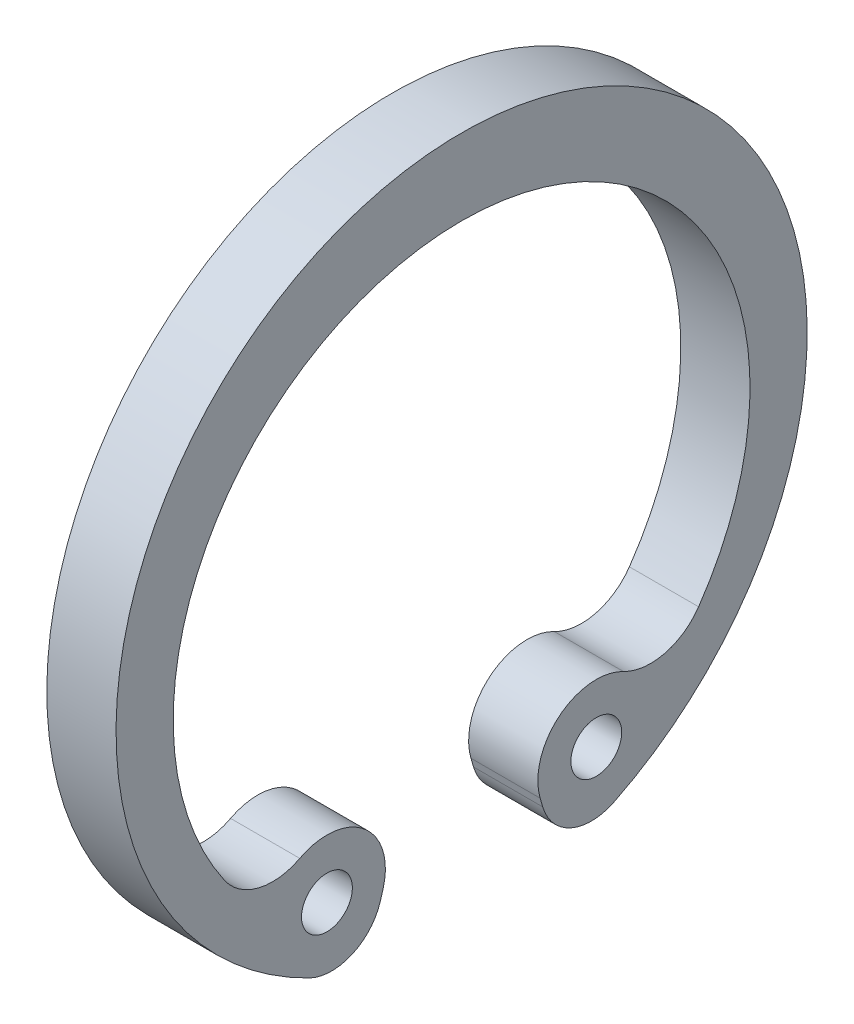
ISO-10303-21;
HEADER;
FILE_DESCRIPTION(('STEP AP214'),'2;1');
FILE_NAME('part.step','',(''),(''),'','','');
FILE_SCHEMA(('AUTOMOTIVE_DESIGN { 1 0 10303 214 1 1 1 1 }'));
ENDSEC;
DATA;
#1=APPLICATION_CONTEXT('core data for automotive mechanical design processes');
#2=APPLICATION_PROTOCOL_DEFINITION('international standard','automotive_design',2000,#1);
#3=PRODUCT_CONTEXT('',#1,'mechanical');
#4=PRODUCT('Part','Part','',(#3));
#5=PRODUCT_RELATED_PRODUCT_CATEGORY('part','',(#4));
#6=PRODUCT_DEFINITION_FORMATION('','',#4);
#7=PRODUCT_DEFINITION_CONTEXT('part definition',#1,'design');
#8=PRODUCT_DEFINITION('design','',#6,#7);
#9=PRODUCT_DEFINITION_SHAPE('','',#8);
#10=(LENGTH_UNIT() NAMED_UNIT(*) SI_UNIT(.MILLI.,.METRE.));
#11=(NAMED_UNIT(*) PLANE_ANGLE_UNIT() SI_UNIT($,.RADIAN.));
#12=(NAMED_UNIT(*) SI_UNIT($,.STERADIAN.) SOLID_ANGLE_UNIT());
#13=UNCERTAINTY_MEASURE_WITH_UNIT(LENGTH_MEASURE(1.E-05),#10,'distance_accuracy_value','');
#14=(GEOMETRIC_REPRESENTATION_CONTEXT(3) GLOBAL_UNCERTAINTY_ASSIGNED_CONTEXT((#13)) GLOBAL_UNIT_ASSIGNED_CONTEXT((#10,
#11,#12)) REPRESENTATION_CONTEXT('',''));
#15=CARTESIAN_POINT('',(0.,0.,0.));
#16=DIRECTION('',(0.,0.,1.));
#17=DIRECTION('',(1.,0.,0.));
#18=AXIS2_PLACEMENT_3D('',#15,#16,#17);
#19=CARTESIAN_POINT('',(-0.6,-4.58686828511237,-2.25257408608243));
#20=DIRECTION('',(1.,0.,0.));
#21=DIRECTION('',(0.,0.,-1.));
#22=AXIS2_PLACEMENT_3D('',#19,#20,#21);
#23=CYLINDRICAL_SURFACE('',#22,0.881057268722478);
#24=CARTESIAN_POINT('',(0.6,-4.58686828511237,-2.25257408608243));
#25=DIRECTION('',(1.,0.,0.));
#26=DIRECTION('',(0.,0.,-1.));
#27=AXIS2_PLACEMENT_3D('',#24,#25,#26);
#28=CIRCLE('',#27,0.881057268722478);
#29=CARTESIAN_POINT('',(0.6,-4.83307544942581,-1.40661667402822));
#30=VERTEX_POINT('',#29);
#31=CARTESIAN_POINT('',(0.6,-5.37770764461454,-2.64094892851035));
#32=VERTEX_POINT('',#31);
#33=EDGE_CURVE('E142',#30,#32,#28,.T.);
#34=ORIENTED_EDGE('',*,*,#33,.F.);
#35=DIRECTION('',(1.,0.,0.));
#36=VECTOR('',#35,1.);
#37=CARTESIAN_POINT('',(-0.6,-4.83307544942581,-1.40661667402822));
#38=LINE('',#37,#36);
#39=CARTESIAN_POINT('',(-0.6,-4.83307544942581,-1.40661667402822));
#40=VERTEX_POINT('',#39);
#41=EDGE_CURVE('E11',#40,#30,#38,.T.);
#42=ORIENTED_EDGE('',*,*,#41,.F.);
#43=CARTESIAN_POINT('',(-0.6,-4.58686828511237,-2.25257408608243));
#44=DIRECTION('',(1.,0.,0.));
#45=DIRECTION('',(0.,0.,-1.));
#46=AXIS2_PLACEMENT_3D('',#43,#44,#45);
#47=CIRCLE('',#46,0.881057268722478);
#48=CARTESIAN_POINT('',(-0.6,-5.37770764461454,-2.64094892851035));
#49=VERTEX_POINT('',#48);
#50=EDGE_CURVE('E169',#40,#49,#47,.T.);
#51=ORIENTED_EDGE('',*,*,#50,.T.);
#52=DIRECTION('',(1.,0.,0.));
#53=VECTOR('',#52,1.);
#54=CARTESIAN_POINT('',(-0.6,-5.37770764461454,-2.64094892851035));
#55=LINE('',#54,#53);
#56=EDGE_CURVE('E36',#49,#32,#55,.T.);
#57=ORIENTED_EDGE('',*,*,#56,.T.);
#58=EDGE_LOOP('',(#34,#42,#51,#57));
#59=FACE_BOUND('',#58,.T.);
#60=ADVANCED_FACE('F33',(#59),#23,.T.);
#61=CARTESIAN_POINT('',(-0.6,-4.67960518164758,-1.36195073825215));
#62=DIRECTION('',(0.,-0.279445131495752,0.96016166268151));
#63=DIRECTION('',(0.,-0.96016166268151,-0.279445131495752));
#64=AXIS2_PLACEMENT_3D('',#61,#62,#63);
#65=PLANE('',#64);
#66=DIRECTION('',(0.,-0.96016166268151,-0.279445131495752));
#67=VECTOR('',#66,1.);
#68=CARTESIAN_POINT('',(0.6,-4.67960518164758,-1.36195073825215));
#69=LINE('',#68,#67);
#70=CARTESIAN_POINT('',(0.6,-4.67960518164758,-1.36195073825215));
#71=VERTEX_POINT('',#70);
#72=EDGE_CURVE('E167',#71,#30,#69,.T.);
#73=ORIENTED_EDGE('',*,*,#72,.F.);
#74=DIRECTION('',(1.,0.,0.));
#75=VECTOR('',#74,1.);
#76=CARTESIAN_POINT('',(-0.6,-4.67960518164758,-1.36195073825215));
#77=LINE('',#76,#75);
#78=CARTESIAN_POINT('',(-0.6,-4.67960518164758,-1.36195073825215));
#79=VERTEX_POINT('',#78);
#80=EDGE_CURVE('E42',#79,#71,#77,.T.);
#81=ORIENTED_EDGE('',*,*,#80,.F.);
#82=DIRECTION('',(0.,-0.96016166268151,-0.279445131495752));
#83=VECTOR('',#82,1.);
#84=CARTESIAN_POINT('',(-0.6,-4.67960518164758,-1.36195073825215));
#85=LINE('',#84,#83);
#86=EDGE_CURVE('E132',#79,#40,#85,.T.);
#87=ORIENTED_EDGE('',*,*,#86,.T.);
#88=ORIENTED_EDGE('',*,*,#41,.T.);
#89=EDGE_LOOP('',(#73,#81,#87,#88));
#90=FACE_BOUND('',#89,.T.);
#91=ADVANCED_FACE('F185',(#90),#65,.T.);
#92=CARTESIAN_POINT('',(-0.6,-4.39646694268709,-2.33480176211454));
#93=DIRECTION('',(1.,0.,0.));
#94=DIRECTION('',(0.,0.,-1.));
#95=AXIS2_PLACEMENT_3D('',#92,#93,#94);
#96=CYLINDRICAL_SURFACE('',#95,1.01321585903087);
#97=CARTESIAN_POINT('',(0.6,-4.39646694268709,-2.33480176211454));
#98=DIRECTION('',(1.,0.,0.));
#99=DIRECTION('',(0.,0.,-1.));
#100=AXIS2_PLACEMENT_3D('',#97,#98,#99);
#101=CIRCLE('',#100,1.01321585903087);
#102=CARTESIAN_POINT('',(0.6,-3.49924782725715,-2.80555035308298));
#103=VERTEX_POINT('',#102);
#104=EDGE_CURVE('E119',#103,#71,#101,.T.);
#105=ORIENTED_EDGE('',*,*,#104,.F.);
#106=DIRECTION('',(1.,0.,0.));
#107=VECTOR('',#106,1.);
#108=CARTESIAN_POINT('',(-0.6,-3.49924782725715,-2.80555035308298));
#109=LINE('',#108,#107);
#110=CARTESIAN_POINT('',(-0.6,-3.49924782725715,-2.80555035308298));
#111=VERTEX_POINT('',#110);
#112=EDGE_CURVE('E114',#111,#103,#109,.T.);
#113=ORIENTED_EDGE('',*,*,#112,.F.);
#114=CARTESIAN_POINT('',(-0.6,-4.39646694268709,-2.33480176211454));
#115=DIRECTION('',(1.,0.,0.));
#116=DIRECTION('',(0.,0.,-1.));
#117=AXIS2_PLACEMENT_3D('',#114,#115,#116);
#118=CIRCLE('',#117,1.01321585903087);
#119=EDGE_CURVE('E117',#111,#79,#118,.T.);
#120=ORIENTED_EDGE('',*,*,#119,.T.);
#121=ORIENTED_EDGE('',*,*,#80,.T.);
#122=EDGE_LOOP('',(#105,#113,#120,#121));
#123=FACE_BOUND('',#122,.T.);
#124=ADVANCED_FACE('F116',(#123),#96,.T.);
#125=CARTESIAN_POINT('',(-0.6,-2.6020287118272,-3.27629894405145));
#126=DIRECTION('',(1.,0.,0.));
#127=DIRECTION('',(0.,0.,-1.));
#128=AXIS2_PLACEMENT_3D('',#125,#126,#127);
#129=CYLINDRICAL_SURFACE('',#128,1.01321585903093);
#130=CARTESIAN_POINT('',(0.6,-2.6020287118272,-3.27629894405145));
#131=DIRECTION('',(-1.,0.,0.));
#132=DIRECTION('',(0.,0.,1.));
#133=AXIS2_PLACEMENT_3D('',#130,#131,#132);
#134=CIRCLE('',#133,1.01321585903093);
#135=CARTESIAN_POINT('',(0.6,-3.17934961159855,-4.10894950441815));
#136=VERTEX_POINT('',#135);
#137=EDGE_CURVE('E164',#136,#103,#134,.T.);
#138=ORIENTED_EDGE('',*,*,#137,.F.);
#139=DIRECTION('',(1.,0.,0.));
#140=VECTOR('',#139,1.);
#141=CARTESIAN_POINT('',(-0.6,-3.17934961159855,-4.10894950441815));
#142=LINE('',#141,#140);
#143=CARTESIAN_POINT('',(-0.6,-3.17934961159855,-4.10894950441815));
#144=VERTEX_POINT('',#143);
#145=EDGE_CURVE('E124',#144,#136,#142,.T.);
#146=ORIENTED_EDGE('',*,*,#145,.F.);
#147=CARTESIAN_POINT('',(-0.6,-2.6020287118272,-3.27629894405145));
#148=DIRECTION('',(-1.,0.,0.));
#149=DIRECTION('',(0.,0.,1.));
#150=AXIS2_PLACEMENT_3D('',#147,#148,#149);
#151=CIRCLE('',#150,1.01321585903093);
#152=EDGE_CURVE('E130',#144,#111,#151,.T.);
#153=ORIENTED_EDGE('',*,*,#152,.T.);
#154=ORIENTED_EDGE('',*,*,#112,.T.);
#155=EDGE_LOOP('',(#138,#146,#153,#154));
#156=FACE_BOUND('',#155,.T.);
#157=ADVANCED_FACE('F134',(#156),#129,.F.);
#158=CARTESIAN_POINT('',(-0.6,-0.330396475770925,0.));
#159=DIRECTION('',(1.,0.,0.));
#160=DIRECTION('',(0.,0.,-1.));
#161=AXIS2_PLACEMENT_3D('',#158,#159,#160);
#162=CYLINDRICAL_SURFACE('',#161,5.);
#163=CARTESIAN_POINT('',(0.6,-0.330396475770925,0.));
#164=DIRECTION('',(-1.,0.,0.));
#165=DIRECTION('',(0.,0.,1.));
#166=AXIS2_PLACEMENT_3D('',#163,#164,#165);
#167=CIRCLE('',#166,5.);
#168=CARTESIAN_POINT('',(0.6,-3.17934961159847,4.10894950441815));
#169=VERTEX_POINT('',#168);
#170=EDGE_CURVE('E161',#169,#136,#167,.T.);
#171=ORIENTED_EDGE('',*,*,#170,.F.);
#172=DIRECTION('',(1.,0.,0.));
#173=VECTOR('',#172,1.);
#174=CARTESIAN_POINT('',(-0.6,-3.17934961159847,4.10894950441815));
#175=LINE('',#174,#173);
#176=CARTESIAN_POINT('',(-0.6,-3.17934961159847,4.10894950441815));
#177=VERTEX_POINT('',#176);
#178=EDGE_CURVE('E173',#177,#169,#175,.T.);
#179=ORIENTED_EDGE('',*,*,#178,.F.);
#180=CARTESIAN_POINT('',(-0.6,-0.330396475770925,0.));
#181=DIRECTION('',(-1.,0.,0.));
#182=DIRECTION('',(0.,0.,1.));
#183=AXIS2_PLACEMENT_3D('',#180,#181,#182);
#184=CIRCLE('',#183,5.);
#185=EDGE_CURVE('E135',#177,#144,#184,.T.);
#186=ORIENTED_EDGE('',*,*,#185,.T.);
#187=ORIENTED_EDGE('',*,*,#145,.T.);
#188=EDGE_LOOP('',(#171,#179,#186,#187));
#189=FACE_BOUND('',#188,.T.);
#190=ADVANCED_FACE('F198',(#189),#162,.F.);
#191=CARTESIAN_POINT('',(-0.6,-2.60202871182723,3.27629894405141));
#192=DIRECTION('',(1.,0.,0.));
#193=DIRECTION('',(0.,0.,-1.));
#194=AXIS2_PLACEMENT_3D('',#191,#192,#193);
#195=CYLINDRICAL_SURFACE('',#194,1.0132158590309);
#196=CARTESIAN_POINT('',(0.6,-2.60202871182723,3.27629894405141));
#197=DIRECTION('',(-1.,0.,0.));
#198=DIRECTION('',(0.,0.,1.));
#199=AXIS2_PLACEMENT_3D('',#196,#197,#198);
#200=CIRCLE('',#199,1.0132158590309);
#201=CARTESIAN_POINT('',(0.6,-3.49924782725722,2.805550353083));
#202=VERTEX_POINT('',#201);
#203=EDGE_CURVE('E158',#202,#169,#200,.T.);
#204=ORIENTED_EDGE('',*,*,#203,.F.);
#205=DIRECTION('',(1.,0.,0.));
#206=VECTOR('',#205,1.);
#207=CARTESIAN_POINT('',(-0.6,-3.49924782725722,2.805550353083));
#208=LINE('',#207,#206);
#209=CARTESIAN_POINT('',(-0.6,-3.49924782725722,2.805550353083));
#210=VERTEX_POINT('',#209);
#211=EDGE_CURVE('E175',#210,#202,#208,.T.);
#212=ORIENTED_EDGE('',*,*,#211,.F.);
#213=CARTESIAN_POINT('',(-0.6,-2.60202871182723,3.27629894405141));
#214=DIRECTION('',(-1.,0.,0.));
#215=DIRECTION('',(0.,0.,1.));
#216=AXIS2_PLACEMENT_3D('',#213,#214,#215);
#217=CIRCLE('',#216,1.0132158590309);
#218=EDGE_CURVE('E137',#210,#177,#217,.T.);
#219=ORIENTED_EDGE('',*,*,#218,.T.);
#220=ORIENTED_EDGE('',*,*,#178,.T.);
#221=EDGE_LOOP('',(#204,#212,#219,#220));
#222=FACE_BOUND('',#221,.T.);
#223=ADVANCED_FACE('F201',(#222),#195,.F.);
#224=CARTESIAN_POINT('',(-0.6,-4.39646694268709,2.33480176211454));
#225=DIRECTION('',(1.,0.,0.));
#226=DIRECTION('',(0.,0.,-1.));
#227=AXIS2_PLACEMENT_3D('',#224,#225,#226);
#228=CYLINDRICAL_SURFACE('',#227,1.01321585903086);
#229=CARTESIAN_POINT('',(0.6,-4.39646694268709,2.33480176211454));
#230=DIRECTION('',(1.,0.,0.));
#231=DIRECTION('',(0.,0.,-1.));
#232=AXIS2_PLACEMENT_3D('',#229,#230,#231);
#233=CIRCLE('',#232,1.01321585903086);
#234=CARTESIAN_POINT('',(0.6,-4.67960518164754,1.36195073825219));
#235=VERTEX_POINT('',#234);
#236=EDGE_CURVE('E155',#235,#202,#233,.T.);
#237=ORIENTED_EDGE('',*,*,#236,.F.);
#238=DIRECTION('',(1.,0.,0.));
#239=VECTOR('',#238,1.);
#240=CARTESIAN_POINT('',(-0.6,-4.67960518164754,1.36195073825219));
#241=LINE('',#240,#239);
#242=CARTESIAN_POINT('',(-0.6,-4.67960518164754,1.36195073825219));
#243=VERTEX_POINT('',#242);
#244=EDGE_CURVE('E177',#243,#235,#241,.T.);
#245=ORIENTED_EDGE('',*,*,#244,.F.);
#246=CARTESIAN_POINT('',(-0.6,-4.39646694268709,2.33480176211454));
#247=DIRECTION('',(1.,0.,0.));
#248=DIRECTION('',(0.,0.,-1.));
#249=AXIS2_PLACEMENT_3D('',#246,#247,#248);
#250=CIRCLE('',#249,1.01321585903086);
#251=EDGE_CURVE('E261',#243,#210,#250,.T.);
#252=ORIENTED_EDGE('',*,*,#251,.T.);
#253=ORIENTED_EDGE('',*,*,#211,.T.);
#254=EDGE_LOOP('',(#237,#245,#252,#253));
#255=FACE_BOUND('',#254,.T.);
#256=ADVANCED_FACE('F205',(#255),#228,.T.);
#257=CARTESIAN_POINT('',(-0.6,-4.8330754494258,1.40661667402822));
#258=DIRECTION('',(0.,-0.279445131495739,-0.960161662681514));
#259=DIRECTION('',(0.,0.960161662681514,-0.279445131495739));
#260=AXIS2_PLACEMENT_3D('',#257,#258,#259);
#261=PLANE('',#260);
#262=DIRECTION('',(0.,0.960161662681514,-0.279445131495739));
#263=VECTOR('',#262,1.);
#264=CARTESIAN_POINT('',(0.6,-4.8330754494258,1.40661667402822));
#265=LINE('',#264,#263);
#266=CARTESIAN_POINT('',(0.6,-4.8330754494258,1.40661667402822));
#267=VERTEX_POINT('',#266);
#268=EDGE_CURVE('E152',#267,#235,#265,.T.);
#269=ORIENTED_EDGE('',*,*,#268,.F.);
#270=DIRECTION('',(1.,0.,0.));
#271=VECTOR('',#270,1.);
#272=CARTESIAN_POINT('',(-0.6,-4.8330754494258,1.40661667402822));
#273=LINE('',#272,#271);
#274=CARTESIAN_POINT('',(-0.6,-4.8330754494258,1.40661667402822));
#275=VERTEX_POINT('',#274);
#276=EDGE_CURVE('E179',#275,#267,#273,.T.);
#277=ORIENTED_EDGE('',*,*,#276,.F.);
#278=DIRECTION('',(0.,0.960161662681514,-0.279445131495739));
#279=VECTOR('',#278,1.);
#280=CARTESIAN_POINT('',(-0.6,-4.8330754494258,1.40661667402822));
#281=LINE('',#280,#279);
#282=EDGE_CURVE('E258',#275,#243,#281,.T.);
#283=ORIENTED_EDGE('',*,*,#282,.T.);
#284=ORIENTED_EDGE('',*,*,#244,.T.);
#285=EDGE_LOOP('',(#269,#277,#283,#284));
#286=FACE_BOUND('',#285,.T.);
#287=ADVANCED_FACE('F209',(#286),#261,.T.);
#288=CARTESIAN_POINT('',(-0.6,-4.58686828511237,2.25257408608243));
#289=DIRECTION('',(1.,0.,0.));
#290=DIRECTION('',(0.,0.,-1.));
#291=AXIS2_PLACEMENT_3D('',#288,#289,#290);
#292=CYLINDRICAL_SURFACE('',#291,0.881057268722478);
#293=CARTESIAN_POINT('',(0.6,-4.58686828511237,2.25257408608243));
#294=DIRECTION('',(1.,0.,0.));
#295=DIRECTION('',(0.,0.,-1.));
#296=AXIS2_PLACEMENT_3D('',#293,#294,#295);
#297=CIRCLE('',#296,0.881057268722478);
#298=CARTESIAN_POINT('',(0.6,-5.37770764461453,2.64094892851036));
#299=VERTEX_POINT('',#298);
#300=EDGE_CURVE('E149',#299,#267,#297,.T.);
#301=ORIENTED_EDGE('',*,*,#300,.F.);
#302=DIRECTION('',(1.,0.,0.));
#303=VECTOR('',#302,1.);
#304=CARTESIAN_POINT('',(-0.6,-5.37770764461453,2.64094892851036));
#305=LINE('',#304,#303);
#306=CARTESIAN_POINT('',(-0.6,-5.37770764461453,2.64094892851036));
#307=VERTEX_POINT('',#306);
#308=EDGE_CURVE('E180',#307,#299,#305,.T.);
#309=ORIENTED_EDGE('',*,*,#308,.F.);
#310=CARTESIAN_POINT('',(-0.6,-4.58686828511237,2.25257408608243));
#311=DIRECTION('',(1.,0.,0.));
#312=DIRECTION('',(0.,0.,-1.));
#313=AXIS2_PLACEMENT_3D('',#310,#311,#312);
#314=CIRCLE('',#313,0.881057268722478);
#315=EDGE_CURVE('E255',#307,#275,#314,.T.);
#316=ORIENTED_EDGE('',*,*,#315,.T.);
#317=ORIENTED_EDGE('',*,*,#276,.T.);
#318=EDGE_LOOP('',(#301,#309,#316,#317));
#319=FACE_BOUND('',#318,.T.);
#320=ADVANCED_FACE('F213',(#319),#292,.T.);
#321=CARTESIAN_POINT('',(-0.6,0.,0.));
#322=DIRECTION('',(1.,0.,0.));
#323=DIRECTION('',(0.,0.,-1.));
#324=AXIS2_PLACEMENT_3D('',#321,#322,#323);
#325=CYLINDRICAL_SURFACE('',#324,5.99118942731283);
#326=CARTESIAN_POINT('',(0.6,0.,0.));
#327=DIRECTION('',(1.,0.,0.));
#328=DIRECTION('',(0.,0.,-1.));
#329=AXIS2_PLACEMENT_3D('',#326,#327,#328);
#330=CIRCLE('',#329,5.99118942731283);
#331=EDGE_CURVE('E145',#32,#299,#330,.T.);
#332=ORIENTED_EDGE('',*,*,#331,.F.);
#333=ORIENTED_EDGE('',*,*,#56,.F.);
#334=CARTESIAN_POINT('',(-0.6,0.,0.));
#335=DIRECTION('',(1.,0.,0.));
#336=DIRECTION('',(0.,0.,-1.));
#337=AXIS2_PLACEMENT_3D('',#334,#335,#336);
#338=CIRCLE('',#337,5.99118942731283);
#339=EDGE_CURVE('E253',#49,#307,#338,.T.);
#340=ORIENTED_EDGE('',*,*,#339,.T.);
#341=ORIENTED_EDGE('',*,*,#308,.T.);
#342=EDGE_LOOP('',(#332,#333,#340,#341));
#343=FACE_BOUND('',#342,.T.);
#344=ADVANCED_FACE('F182',(#343),#325,.T.);
#345=CARTESIAN_POINT('',(-0.6,-4.58686828511237,-2.25257408608243));
#346=DIRECTION('',(1.,0.,0.));
#347=DIRECTION('',(0.,0.,-1.));
#348=AXIS2_PLACEMENT_3D('',#345,#346,#347);
#349=PLANE('',#348);
#350=CARTESIAN_POINT('',(-0.6,-4.39646694268709,-2.33480176211454));
#351=DIRECTION('',(1.,0.,0.));
#352=DIRECTION('',(0.,0.,1.));
#353=AXIS2_PLACEMENT_3D('',#350,#351,#352);
#354=CIRCLE('',#353,0.440528634361234);
#355=CARTESIAN_POINT('',(-0.6,-4.39646694268709,-1.8942731277533));
#356=VERTEX_POINT('',#355);
#357=EDGE_CURVE('E240',#356,#356,#354,.T.);
#358=ORIENTED_EDGE('',*,*,#357,.T.);
#359=EDGE_LOOP('',(#358));
#360=FACE_BOUND('',#359,.T.);
#361=CARTESIAN_POINT('',(-0.6,-4.39646694268709,2.33480176211454));
#362=DIRECTION('',(1.,0.,0.));
#363=DIRECTION('',(0.,0.,1.));
#364=AXIS2_PLACEMENT_3D('',#361,#362,#363);
#365=CIRCLE('',#364,0.440528634361233);
#366=CARTESIAN_POINT('',(-0.6,-4.39646694268709,2.77533039647577));
#367=VERTEX_POINT('',#366);
#368=EDGE_CURVE('E146',#367,#367,#365,.T.);
#369=ORIENTED_EDGE('',*,*,#368,.T.);
#370=EDGE_LOOP('',(#369));
#371=FACE_BOUND('',#370,.T.);
#372=ORIENTED_EDGE('',*,*,#50,.F.);
#373=ORIENTED_EDGE('',*,*,#86,.F.);
#374=ORIENTED_EDGE('',*,*,#119,.F.);
#375=ORIENTED_EDGE('',*,*,#152,.F.);
#376=ORIENTED_EDGE('',*,*,#185,.F.);
#377=ORIENTED_EDGE('',*,*,#218,.F.);
#378=ORIENTED_EDGE('',*,*,#251,.F.);
#379=ORIENTED_EDGE('',*,*,#282,.F.);
#380=ORIENTED_EDGE('',*,*,#315,.F.);
#381=ORIENTED_EDGE('',*,*,#339,.F.);
#382=EDGE_LOOP('',(#372,#373,#374,#375,#376,#377,#378,#379,#380,#381));
#383=FACE_BOUND('',#382,.T.);
#384=ADVANCED_FACE('F128',(#360,#371,#383),#349,.F.);
#385=CARTESIAN_POINT('',(0.6,-4.58686828511237,-2.25257408608243));
#386=DIRECTION('',(1.,0.,0.));
#387=DIRECTION('',(0.,0.,-1.));
#388=AXIS2_PLACEMENT_3D('',#385,#386,#387);
#389=PLANE('',#388);
#390=CARTESIAN_POINT('',(0.6,-4.39646694268709,-2.33480176211454));
#391=DIRECTION('',(1.,0.,0.));
#392=DIRECTION('',(0.,0.,1.));
#393=AXIS2_PLACEMENT_3D('',#390,#391,#392);
#394=CIRCLE('',#393,0.440528634361234);
#395=CARTESIAN_POINT('',(0.6,-4.39646694268709,-1.8942731277533));
#396=VERTEX_POINT('',#395);
#397=EDGE_CURVE('E243',#396,#396,#394,.T.);
#398=ORIENTED_EDGE('',*,*,#397,.F.);
#399=EDGE_LOOP('',(#398));
#400=FACE_BOUND('',#399,.T.);
#401=CARTESIAN_POINT('',(0.6,-4.39646694268709,2.33480176211454));
#402=DIRECTION('',(1.,0.,0.));
#403=DIRECTION('',(0.,0.,1.));
#404=AXIS2_PLACEMENT_3D('',#401,#402,#403);
#405=CIRCLE('',#404,0.440528634361233);
#406=CARTESIAN_POINT('',(0.6,-4.39646694268709,2.77533039647577));
#407=VERTEX_POINT('',#406);
#408=EDGE_CURVE('E245',#407,#407,#405,.T.);
#409=ORIENTED_EDGE('',*,*,#408,.F.);
#410=EDGE_LOOP('',(#409));
#411=FACE_BOUND('',#410,.T.);
#412=ORIENTED_EDGE('',*,*,#33,.T.);
#413=ORIENTED_EDGE('',*,*,#331,.T.);
#414=ORIENTED_EDGE('',*,*,#300,.T.);
#415=ORIENTED_EDGE('',*,*,#268,.T.);
#416=ORIENTED_EDGE('',*,*,#236,.T.);
#417=ORIENTED_EDGE('',*,*,#203,.T.);
#418=ORIENTED_EDGE('',*,*,#170,.T.);
#419=ORIENTED_EDGE('',*,*,#137,.T.);
#420=ORIENTED_EDGE('',*,*,#104,.T.);
#421=ORIENTED_EDGE('',*,*,#72,.T.);
#422=EDGE_LOOP('',(#412,#413,#414,#415,#416,#417,#418,#419,#420,#421));
#423=FACE_BOUND('',#422,.T.);
#424=ADVANCED_FACE('F184',(#400,#411,#423),#389,.T.);
#425=CARTESIAN_POINT('',(-0.6,-4.39646694268709,2.33480176211454));
#426=DIRECTION('',(1.,0.,0.));
#427=DIRECTION('',(0.,0.,-1.));
#428=AXIS2_PLACEMENT_3D('',#425,#426,#427);
#429=CYLINDRICAL_SURFACE('',#428,0.440528634361233);
#430=ORIENTED_EDGE('',*,*,#368,.F.);
#431=EDGE_LOOP('',(#430));
#432=FACE_BOUND('',#431,.T.);
#433=ORIENTED_EDGE('',*,*,#408,.T.);
#434=EDGE_LOOP('',(#433));
#435=FACE_BOUND('',#434,.T.);
#436=ADVANCED_FACE('F225',(#432,#435),#429,.F.);
#437=CARTESIAN_POINT('',(-0.6,-4.39646694268709,-2.33480176211454));
#438=DIRECTION('',(1.,0.,0.));
#439=DIRECTION('',(0.,0.,-1.));
#440=AXIS2_PLACEMENT_3D('',#437,#438,#439);
#441=CYLINDRICAL_SURFACE('',#440,0.440528634361234);
#442=ORIENTED_EDGE('',*,*,#357,.F.);
#443=EDGE_LOOP('',(#442));
#444=FACE_BOUND('',#443,.T.);
#445=ORIENTED_EDGE('',*,*,#397,.T.);
#446=EDGE_LOOP('',(#445));
#447=FACE_BOUND('',#446,.T.);
#448=ADVANCED_FACE('F232',(#444,#447),#441,.F.);
#449=CLOSED_SHELL('',(#60,#91,#124,#157,#190,#223,#256,#287,#320,#344,#384,#424,#436,#448));
#450=MANIFOLD_SOLID_BREP('B2',#449);
#451=ADVANCED_BREP_SHAPE_REPRESENTATION('',(#18,#450),#14);
#452=SHAPE_DEFINITION_REPRESENTATION(#9,#451);
ENDSEC;
END-ISO-10303-21;
